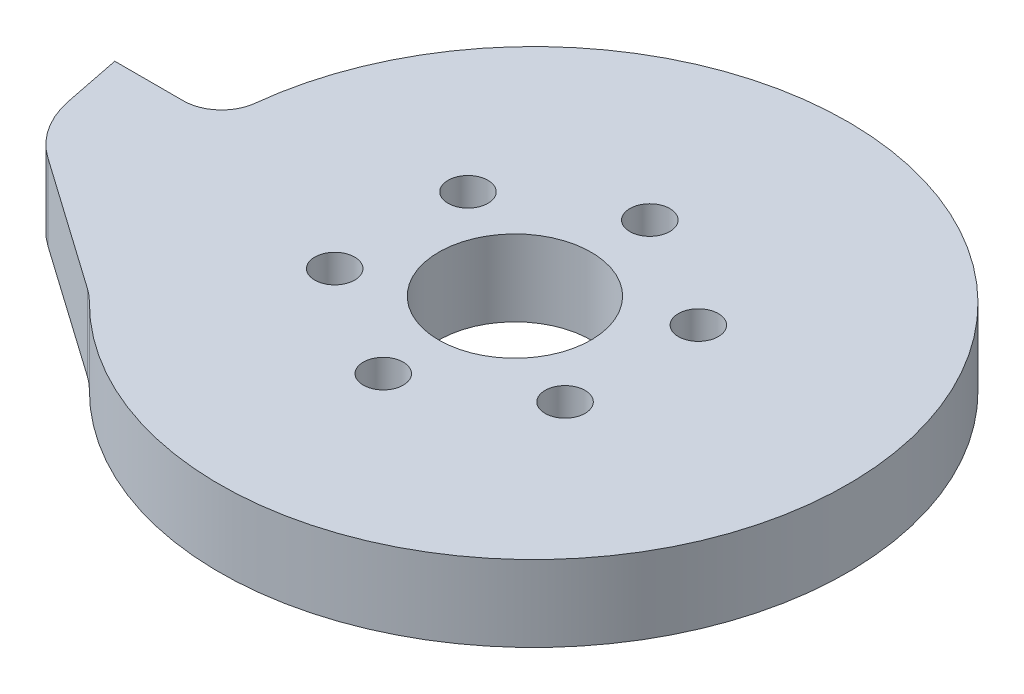
ISO-10303-21;
HEADER;
FILE_DESCRIPTION(('STEP AP214'),'2;1');
FILE_NAME('part.step','',(''),(''),'','','');
FILE_SCHEMA(('AUTOMOTIVE_DESIGN { 1 0 10303 214 1 1 1 1 }'));
ENDSEC;
DATA;
#1=APPLICATION_CONTEXT('core data for automotive mechanical design processes');
#2=APPLICATION_PROTOCOL_DEFINITION('international standard','automotive_design',2000,#1);
#3=PRODUCT_CONTEXT('',#1,'mechanical');
#4=PRODUCT('Part','Part','',(#3));
#5=PRODUCT_RELATED_PRODUCT_CATEGORY('part','',(#4));
#6=PRODUCT_DEFINITION_FORMATION('','',#4);
#7=PRODUCT_DEFINITION_CONTEXT('part definition',#1,'design');
#8=PRODUCT_DEFINITION('design','',#6,#7);
#9=PRODUCT_DEFINITION_SHAPE('','',#8);
#10=(LENGTH_UNIT() NAMED_UNIT(*) SI_UNIT(.MILLI.,.METRE.));
#11=(NAMED_UNIT(*) PLANE_ANGLE_UNIT() SI_UNIT($,.RADIAN.));
#12=(NAMED_UNIT(*) SI_UNIT($,.STERADIAN.) SOLID_ANGLE_UNIT());
#13=UNCERTAINTY_MEASURE_WITH_UNIT(LENGTH_MEASURE(1.E-05),#10,'distance_accuracy_value','');
#14=(GEOMETRIC_REPRESENTATION_CONTEXT(3) GLOBAL_UNCERTAINTY_ASSIGNED_CONTEXT((#13)) GLOBAL_UNIT_ASSIGNED_CONTEXT((#10,
#11,#12)) REPRESENTATION_CONTEXT('',''));
#15=CARTESIAN_POINT('',(0.,0.,0.));
#16=DIRECTION('',(0.,0.,1.));
#17=DIRECTION('',(1.,0.,0.));
#18=AXIS2_PLACEMENT_3D('',#15,#16,#17);
#19=CARTESIAN_POINT('',(0.,8.,0.));
#20=DIRECTION('',(0.,-1.,0.));
#21=DIRECTION('',(0.,0.,-1.));
#22=AXIS2_PLACEMENT_3D('',#19,#20,#21);
#23=PLANE('',#22);
#24=CARTESIAN_POINT('',(-1.45237262441028,8.,-13.6489964305643));
#25=DIRECTION('',(0.,1.,0.));
#26=DIRECTION('',(0.,0.,1.));
#27=AXIS2_PLACEMENT_3D('',#24,#25,#26);
#28=CIRCLE('',#27,2.1);
#29=CARTESIAN_POINT('',(-1.45237262441028,8.,-11.5489964305643));
#30=VERTEX_POINT('',#29);
#31=EDGE_CURVE('E198',#30,#30,#28,.T.);
#32=ORIENTED_EDGE('',*,*,#31,.F.);
#33=EDGE_LOOP('',(#32));
#34=FACE_BOUND('',#33,.T.);
#35=CARTESIAN_POINT('',(-13.5704044247265,8.,-6.66966658707766));
#36=DIRECTION('',(0.,1.,0.));
#37=DIRECTION('',(0.,0.,1.));
#38=AXIS2_PLACEMENT_3D('',#35,#36,#37);
#39=CIRCLE('',#38,2.1);
#40=CARTESIAN_POINT('',(-13.5704044247265,8.,-4.56966658707766));
#41=VERTEX_POINT('',#40);
#42=EDGE_CURVE('E199',#41,#41,#39,.T.);
#43=ORIENTED_EDGE('',*,*,#42,.F.);
#44=EDGE_LOOP('',(#43));
#45=FACE_BOUND('',#44,.T.);
#46=CARTESIAN_POINT('',(-13.5851433790342,8.,7.31452171760717));
#47=DIRECTION('',(0.,1.,0.));
#48=DIRECTION('',(0.,0.,1.));
#49=AXIS2_PLACEMENT_3D('',#46,#47,#48);
#50=CIRCLE('',#49,2.1);
#51=CARTESIAN_POINT('',(-13.5851433790342,8.,9.41452171760717));
#52=VERTEX_POINT('',#51);
#53=EDGE_CURVE('E173',#52,#52,#50,.T.);
#54=ORIENTED_EDGE('',*,*,#53,.F.);
#55=EDGE_LOOP('',(#54));
#56=FACE_BOUND('',#55,.T.);
#57=CARTESIAN_POINT('',(-1.48185053302583,8.,14.3193801788053));
#58=DIRECTION('',(0.,1.,0.));
#59=DIRECTION('',(0.,0.,1.));
#60=AXIS2_PLACEMENT_3D('',#57,#58,#59);
#61=CIRCLE('',#60,2.1);
#62=CARTESIAN_POINT('',(-1.48185053302583,8.,16.4193801788053));
#63=VERTEX_POINT('',#62);
#64=EDGE_CURVE('E180',#63,#63,#61,.T.);
#65=ORIENTED_EDGE('',*,*,#64,.F.);
#66=EDGE_LOOP('',(#65));
#67=FACE_BOUND('',#66,.T.);
#68=CARTESIAN_POINT('',(10.6361812672904,8.,7.34005033531866));
#69=DIRECTION('',(0.,1.,0.));
#70=DIRECTION('',(0.,0.,1.));
#71=AXIS2_PLACEMENT_3D('',#68,#69,#70);
#72=CIRCLE('',#71,2.1);
#73=CARTESIAN_POINT('',(10.6361812672904,8.,9.44005033531866));
#74=VERTEX_POINT('',#73);
#75=EDGE_CURVE('E186',#74,#74,#72,.T.);
#76=ORIENTED_EDGE('',*,*,#75,.F.);
#77=EDGE_LOOP('',(#76));
#78=FACE_BOUND('',#77,.T.);
#79=CARTESIAN_POINT('',(10.6509202215981,8.,-6.64413796936617));
#80=DIRECTION('',(0.,1.,0.));
#81=DIRECTION('',(0.,0.,1.));
#82=AXIS2_PLACEMENT_3D('',#79,#80,#81);
#83=CIRCLE('',#82,2.1);
#84=CARTESIAN_POINT('',(10.6509202215981,8.,-4.54413796936617));
#85=VERTEX_POINT('',#84);
#86=EDGE_CURVE('E192',#85,#85,#83,.T.);
#87=ORIENTED_EDGE('',*,*,#86,.F.);
#88=EDGE_LOOP('',(#87));
#89=FACE_BOUND('',#88,.T.);
#90=DIRECTION('',(0.196116135138184,0.,0.98058067569092));
#91=VECTOR('',#90,1.);
#92=CARTESIAN_POINT('',(-44.,8.,0.));
#93=LINE('',#92,#91);
#94=CARTESIAN_POINT('',(-44.,8.,0.));
#95=VERTEX_POINT('',#94);
#96=CARTESIAN_POINT('',(-42.7842582914051,8.,6.07870854297468));
#97=VERTEX_POINT('',#96);
#98=EDGE_CURVE('E99',#95,#97,#93,.T.);
#99=ORIENTED_EDGE('',*,*,#98,.T.);
#100=CARTESIAN_POINT('',(-32.9784515344959,8.,4.11754719159284));
#101=DIRECTION('',(0.,-1.,0.));
#102=DIRECTION('',(0.,0.,-1.));
#103=AXIS2_PLACEMENT_3D('',#100,#101,#102);
#104=CIRCLE('',#103,10.);
#105=CARTESIAN_POINT('',(-38.7281667595452,8.,12.2992814106222));
#106=VERTEX_POINT('',#105);
#107=EDGE_CURVE('E149',#97,#106,#104,.F.);
#108=ORIENTED_EDGE('',*,*,#107,.T.);
#109=DIRECTION('',(0.818173421902933,0.,0.574971522504937));
#110=VECTOR('',#109,1.);
#111=CARTESIAN_POINT('',(-42.,8.,10.));
#112=LINE('',#111,#110);
#113=CARTESIAN_POINT('',(-24.7730111832336,8.,22.1062695548265));
#114=VERTEX_POINT('',#113);
#115=EDGE_CURVE('E114',#106,#114,#112,.T.);
#116=ORIENTED_EDGE('',*,*,#115,.T.);
#117=CARTESIAN_POINT('',(-30.522726408283,8.,30.2880037738559));
#118=DIRECTION('',(0.,-1.,0.));
#119=DIRECTION('',(0.,0.,-1.));
#120=AXIS2_PLACEMENT_3D('',#117,#118,#119);
#121=CIRCLE('',#120,10.);
#122=CARTESIAN_POINT('',(-23.4244179412404,8.,23.2442819659824));
#123=VERTEX_POINT('',#122);
#124=EDGE_CURVE('E11',#114,#123,#121,.T.);
#125=ORIENTED_EDGE('',*,*,#124,.T.);
#126=CARTESIAN_POINT('',(0.,8.,0.));
#127=DIRECTION('',(0.,1.,0.));
#128=DIRECTION('',(0.,0.,-1.));
#129=AXIS2_PLACEMENT_3D('',#126,#127,#128);
#130=CIRCLE('',#129,33.);
#131=CARTESIAN_POINT('',(-32.8065917408505,8.,-3.56756756756757));
#132=VERTEX_POINT('',#131);
#133=EDGE_CURVE('E106',#123,#132,#130,.T.);
#134=ORIENTED_EDGE('',*,*,#133,.T.);
#135=CARTESIAN_POINT('',(-36.783148315499,8.,-4.));
#136=DIRECTION('',(0.,-1.,0.));
#137=DIRECTION('',(0.,0.,-1.));
#138=AXIS2_PLACEMENT_3D('',#135,#136,#137);
#139=CIRCLE('',#138,4.);
#140=CARTESIAN_POINT('',(-36.783148315499,8.,0.));
#141=VERTEX_POINT('',#140);
#142=EDGE_CURVE('E102',#132,#141,#139,.T.);
#143=ORIENTED_EDGE('',*,*,#142,.T.);
#144=DIRECTION('',(-1.,0.,0.));
#145=VECTOR('',#144,1.);
#146=CARTESIAN_POINT('',(-33.,8.,0.));
#147=LINE('',#146,#145);
#148=EDGE_CURVE('E96',#141,#95,#147,.T.);
#149=ORIENTED_EDGE('',*,*,#148,.T.);
#150=EDGE_LOOP('',(#99,#108,#116,#125,#134,#143,#149));
#151=FACE_BOUND('',#150,.T.);
#152=CARTESIAN_POINT('',(-1.62,8.,0.35));
#153=DIRECTION('',(0.,1.,0.));
#154=DIRECTION('',(0.,0.,1.));
#155=AXIS2_PLACEMENT_3D('',#152,#153,#154);
#156=CIRCLE('',#155,8.);
#157=CARTESIAN_POINT('',(-1.62,8.,8.35));
#158=VERTEX_POINT('',#157);
#159=EDGE_CURVE('E124',#158,#158,#156,.T.);
#160=ORIENTED_EDGE('',*,*,#159,.F.);
#161=EDGE_LOOP('',(#160));
#162=FACE_BOUND('',#161,.T.);
#163=ADVANCED_FACE('F37',(#34,#45,#56,#67,#78,#89,#151,#162),#23,.F.);
#164=CARTESIAN_POINT('',(0.,0.,0.));
#165=DIRECTION('',(0.,-1.,0.));
#166=DIRECTION('',(0.,0.,-1.));
#167=AXIS2_PLACEMENT_3D('',#164,#165,#166);
#168=PLANE('',#167);
#169=CARTESIAN_POINT('',(-1.45237262441028,0.,-13.6489964305643));
#170=DIRECTION('',(0.,1.,0.));
#171=DIRECTION('',(0.,0.,1.));
#172=AXIS2_PLACEMENT_3D('',#169,#170,#171);
#173=CIRCLE('',#172,2.1);
#174=CARTESIAN_POINT('',(-1.45237262441028,0.,-11.5489964305643));
#175=VERTEX_POINT('',#174);
#176=EDGE_CURVE('E170',#175,#175,#173,.T.);
#177=ORIENTED_EDGE('',*,*,#176,.T.);
#178=EDGE_LOOP('',(#177));
#179=FACE_BOUND('',#178,.T.);
#180=CARTESIAN_POINT('',(-13.5704044247265,0.,-6.66966658707766));
#181=DIRECTION('',(0.,1.,0.));
#182=DIRECTION('',(0.,0.,1.));
#183=AXIS2_PLACEMENT_3D('',#180,#181,#182);
#184=CIRCLE('',#183,2.1);
#185=CARTESIAN_POINT('',(-13.5704044247265,0.,-4.56966658707766));
#186=VERTEX_POINT('',#185);
#187=EDGE_CURVE('E177',#186,#186,#184,.T.);
#188=ORIENTED_EDGE('',*,*,#187,.T.);
#189=EDGE_LOOP('',(#188));
#190=FACE_BOUND('',#189,.T.);
#191=CARTESIAN_POINT('',(-13.5851433790342,0.,7.31452171760717));
#192=DIRECTION('',(0.,1.,0.));
#193=DIRECTION('',(0.,0.,1.));
#194=AXIS2_PLACEMENT_3D('',#191,#192,#193);
#195=CIRCLE('',#194,2.1);
#196=CARTESIAN_POINT('',(-13.5851433790342,0.,9.41452171760717));
#197=VERTEX_POINT('',#196);
#198=EDGE_CURVE('E176',#197,#197,#195,.T.);
#199=ORIENTED_EDGE('',*,*,#198,.T.);
#200=EDGE_LOOP('',(#199));
#201=FACE_BOUND('',#200,.T.);
#202=CARTESIAN_POINT('',(-1.48185053302583,0.,14.3193801788053));
#203=DIRECTION('',(0.,1.,0.));
#204=DIRECTION('',(0.,0.,1.));
#205=AXIS2_PLACEMENT_3D('',#202,#203,#204);
#206=CIRCLE('',#205,2.1);
#207=CARTESIAN_POINT('',(-1.48185053302583,0.,16.4193801788053));
#208=VERTEX_POINT('',#207);
#209=EDGE_CURVE('E183',#208,#208,#206,.T.);
#210=ORIENTED_EDGE('',*,*,#209,.T.);
#211=EDGE_LOOP('',(#210));
#212=FACE_BOUND('',#211,.T.);
#213=CARTESIAN_POINT('',(10.6361812672904,0.,7.34005033531866));
#214=DIRECTION('',(0.,1.,0.));
#215=DIRECTION('',(0.,0.,1.));
#216=AXIS2_PLACEMENT_3D('',#213,#214,#215);
#217=CIRCLE('',#216,2.1);
#218=CARTESIAN_POINT('',(10.6361812672904,0.,9.44005033531866));
#219=VERTEX_POINT('',#218);
#220=EDGE_CURVE('E189',#219,#219,#217,.T.);
#221=ORIENTED_EDGE('',*,*,#220,.T.);
#222=EDGE_LOOP('',(#221));
#223=FACE_BOUND('',#222,.T.);
#224=CARTESIAN_POINT('',(10.6509202215981,0.,-6.64413796936617));
#225=DIRECTION('',(0.,1.,0.));
#226=DIRECTION('',(0.,0.,1.));
#227=AXIS2_PLACEMENT_3D('',#224,#225,#226);
#228=CIRCLE('',#227,2.1);
#229=CARTESIAN_POINT('',(10.6509202215981,0.,-4.54413796936617));
#230=VERTEX_POINT('',#229);
#231=EDGE_CURVE('E195',#230,#230,#228,.T.);
#232=ORIENTED_EDGE('',*,*,#231,.T.);
#233=EDGE_LOOP('',(#232));
#234=FACE_BOUND('',#233,.T.);
#235=DIRECTION('',(0.818173421902933,0.,0.574971522504937));
#236=VECTOR('',#235,1.);
#237=CARTESIAN_POINT('',(-42.,0.,10.));
#238=LINE('',#237,#236);
#239=CARTESIAN_POINT('',(-38.7281667595452,0.,12.2992814106222));
#240=VERTEX_POINT('',#239);
#241=CARTESIAN_POINT('',(-24.7730111832336,0.,22.1062695548265));
#242=VERTEX_POINT('',#241);
#243=EDGE_CURVE('E128',#240,#242,#238,.T.);
#244=ORIENTED_EDGE('',*,*,#243,.F.);
#245=CARTESIAN_POINT('',(-32.9784515344959,0.,4.11754719159284));
#246=DIRECTION('',(0.,-1.,0.));
#247=DIRECTION('',(0.,0.,-1.));
#248=AXIS2_PLACEMENT_3D('',#245,#246,#247);
#249=CIRCLE('',#248,10.);
#250=CARTESIAN_POINT('',(-42.7842582914051,0.,6.07870854297468));
#251=VERTEX_POINT('',#250);
#252=EDGE_CURVE('E60',#240,#251,#249,.T.);
#253=ORIENTED_EDGE('',*,*,#252,.T.);
#254=DIRECTION('',(0.196116135138184,0.,0.98058067569092));
#255=VECTOR('',#254,1.);
#256=CARTESIAN_POINT('',(-44.,0.,0.));
#257=LINE('',#256,#255);
#258=CARTESIAN_POINT('',(-44.,0.,0.));
#259=VERTEX_POINT('',#258);
#260=EDGE_CURVE('E126',#259,#251,#257,.T.);
#261=ORIENTED_EDGE('',*,*,#260,.F.);
#262=DIRECTION('',(-1.,0.,0.));
#263=VECTOR('',#262,1.);
#264=CARTESIAN_POINT('',(-33.,0.,0.));
#265=LINE('',#264,#263);
#266=CARTESIAN_POINT('',(-36.783148315499,0.,0.));
#267=VERTEX_POINT('',#266);
#268=EDGE_CURVE('E112',#267,#259,#265,.T.);
#269=ORIENTED_EDGE('',*,*,#268,.F.);
#270=CARTESIAN_POINT('',(-36.783148315499,0.,-4.));
#271=DIRECTION('',(0.,-1.,0.));
#272=DIRECTION('',(0.,0.,-1.));
#273=AXIS2_PLACEMENT_3D('',#270,#271,#272);
#274=CIRCLE('',#273,4.);
#275=CARTESIAN_POINT('',(-32.8065917408505,0.,-3.56756756756757));
#276=VERTEX_POINT('',#275);
#277=EDGE_CURVE('E135',#267,#276,#274,.F.);
#278=ORIENTED_EDGE('',*,*,#277,.T.);
#279=CARTESIAN_POINT('',(0.,0.,0.));
#280=DIRECTION('',(0.,1.,0.));
#281=DIRECTION('',(0.,0.,-1.));
#282=AXIS2_PLACEMENT_3D('',#279,#280,#281);
#283=CIRCLE('',#282,33.);
#284=CARTESIAN_POINT('',(-23.4244179412404,0.,23.2442819659824));
#285=VERTEX_POINT('',#284);
#286=EDGE_CURVE('E122',#285,#276,#283,.T.);
#287=ORIENTED_EDGE('',*,*,#286,.F.);
#288=CARTESIAN_POINT('',(-30.522726408283,0.,30.2880037738559));
#289=DIRECTION('',(0.,-1.,0.));
#290=DIRECTION('',(0.,0.,-1.));
#291=AXIS2_PLACEMENT_3D('',#288,#289,#290);
#292=CIRCLE('',#291,10.);
#293=EDGE_CURVE('E45',#285,#242,#292,.F.);
#294=ORIENTED_EDGE('',*,*,#293,.T.);
#295=EDGE_LOOP('',(#244,#253,#261,#269,#278,#287,#294));
#296=FACE_BOUND('',#295,.T.);
#297=CARTESIAN_POINT('',(-1.62,0.,0.35));
#298=DIRECTION('',(0.,1.,0.));
#299=DIRECTION('',(0.,0.,1.));
#300=AXIS2_PLACEMENT_3D('',#297,#298,#299);
#301=CIRCLE('',#300,8.);
#302=CARTESIAN_POINT('',(-1.62,0.,8.35));
#303=VERTEX_POINT('',#302);
#304=EDGE_CURVE('E167',#303,#303,#301,.T.);
#305=ORIENTED_EDGE('',*,*,#304,.T.);
#306=EDGE_LOOP('',(#305));
#307=FACE_BOUND('',#306,.T.);
#308=ADVANCED_FACE('F151',(#179,#190,#201,#212,#223,#234,#296,#307),#168,.T.);
#309=CARTESIAN_POINT('',(0.,8.,0.));
#310=DIRECTION('',(0.,-1.,0.));
#311=DIRECTION('',(0.,0.,-1.));
#312=AXIS2_PLACEMENT_3D('',#309,#310,#311);
#313=CYLINDRICAL_SURFACE('',#312,33.);
#314=ORIENTED_EDGE('',*,*,#133,.F.);
#315=DIRECTION('',(0.,-1.,0.));
#316=VECTOR('',#315,1.);
#317=CARTESIAN_POINT('',(-23.4244179412404,8.,23.2442819659824));
#318=LINE('',#317,#316);
#319=EDGE_CURVE('E139',#123,#285,#318,.T.);
#320=ORIENTED_EDGE('',*,*,#319,.T.);
#321=ORIENTED_EDGE('',*,*,#286,.T.);
#322=DIRECTION('',(0.,-1.,0.));
#323=VECTOR('',#322,1.);
#324=CARTESIAN_POINT('',(-32.8065917408505,8.,-3.56756756756757));
#325=LINE('',#324,#323);
#326=EDGE_CURVE('E132',#276,#132,#325,.F.);
#327=ORIENTED_EDGE('',*,*,#326,.T.);
#328=EDGE_LOOP('',(#314,#320,#321,#327));
#329=FACE_BOUND('',#328,.T.);
#330=ADVANCED_FACE('F164',(#329),#313,.T.);
#331=CARTESIAN_POINT('',(-33.,8.,0.));
#332=DIRECTION('',(0.,0.,1.));
#333=DIRECTION('',(1.,0.,0.));
#334=AXIS2_PLACEMENT_3D('',#331,#332,#333);
#335=PLANE('',#334);
#336=ORIENTED_EDGE('',*,*,#148,.F.);
#337=DIRECTION('',(0.,1.,0.));
#338=VECTOR('',#337,1.);
#339=CARTESIAN_POINT('',(-36.783148315499,0.,0.));
#340=LINE('',#339,#338);
#341=EDGE_CURVE('E113',#141,#267,#340,.F.);
#342=ORIENTED_EDGE('',*,*,#341,.T.);
#343=ORIENTED_EDGE('',*,*,#268,.T.);
#344=DIRECTION('',(0.,-1.,0.));
#345=VECTOR('',#344,1.);
#346=CARTESIAN_POINT('',(-44.,8.,0.));
#347=LINE('',#346,#345);
#348=EDGE_CURVE('E109',#95,#259,#347,.T.);
#349=ORIENTED_EDGE('',*,*,#348,.F.);
#350=EDGE_LOOP('',(#336,#342,#343,#349));
#351=FACE_BOUND('',#350,.T.);
#352=ADVANCED_FACE('F110',(#351),#335,.F.);
#353=CARTESIAN_POINT('',(-44.,8.,0.));
#354=DIRECTION('',(0.98058067569092,0.,-0.196116135138184));
#355=DIRECTION('',(-0.196116135138184,0.,-0.98058067569092));
#356=AXIS2_PLACEMENT_3D('',#353,#354,#355);
#357=PLANE('',#356);
#358=ORIENTED_EDGE('',*,*,#260,.T.);
#359=DIRECTION('',(0.,-1.,0.));
#360=VECTOR('',#359,1.);
#361=CARTESIAN_POINT('',(-42.7842582914051,8.,6.07870854297468));
#362=LINE('',#361,#360);
#363=EDGE_CURVE('E52',#251,#97,#362,.F.);
#364=ORIENTED_EDGE('',*,*,#363,.T.);
#365=ORIENTED_EDGE('',*,*,#98,.F.);
#366=ORIENTED_EDGE('',*,*,#348,.T.);
#367=EDGE_LOOP('',(#358,#364,#365,#366));
#368=FACE_BOUND('',#367,.T.);
#369=ADVANCED_FACE('F116',(#368),#357,.F.);
#370=CARTESIAN_POINT('',(-42.,8.,10.));
#371=DIRECTION('',(0.574971522504937,0.,-0.818173421902933));
#372=DIRECTION('',(-0.818173421902933,0.,-0.574971522504937));
#373=AXIS2_PLACEMENT_3D('',#370,#371,#372);
#374=PLANE('',#373);
#375=ORIENTED_EDGE('',*,*,#243,.T.);
#376=DIRECTION('',(0.,1.,0.));
#377=VECTOR('',#376,1.);
#378=CARTESIAN_POINT('',(-24.7730111832336,8.,22.1062695548265));
#379=LINE('',#378,#377);
#380=EDGE_CURVE('E145',#242,#114,#379,.T.);
#381=ORIENTED_EDGE('',*,*,#380,.T.);
#382=ORIENTED_EDGE('',*,*,#115,.F.);
#383=DIRECTION('',(0.,-1.,0.));
#384=VECTOR('',#383,1.);
#385=CARTESIAN_POINT('',(-38.7281667595452,8.,12.2992814106222));
#386=LINE('',#385,#384);
#387=EDGE_CURVE('E142',#106,#240,#386,.T.);
#388=ORIENTED_EDGE('',*,*,#387,.T.);
#389=EDGE_LOOP('',(#375,#381,#382,#388));
#390=FACE_BOUND('',#389,.T.);
#391=ADVANCED_FACE('F157',(#390),#374,.F.);
#392=CARTESIAN_POINT('',(-1.62,8.,0.35));
#393=DIRECTION('',(0.,-1.,0.));
#394=DIRECTION('',(0.,0.,-1.));
#395=AXIS2_PLACEMENT_3D('',#392,#393,#394);
#396=CYLINDRICAL_SURFACE('',#395,8.);
#397=ORIENTED_EDGE('',*,*,#159,.T.);
#398=EDGE_LOOP('',(#397));
#399=FACE_BOUND('',#398,.T.);
#400=ORIENTED_EDGE('',*,*,#304,.F.);
#401=EDGE_LOOP('',(#400));
#402=FACE_BOUND('',#401,.T.);
#403=ADVANCED_FACE('F254',(#399,#402),#396,.F.);
#404=CARTESIAN_POINT('',(-36.783148315499,8.,-4.));
#405=DIRECTION('',(0.,-1.,0.));
#406=DIRECTION('',(0.,0.,-1.));
#407=AXIS2_PLACEMENT_3D('',#404,#405,#406);
#408=CYLINDRICAL_SURFACE('',#407,4.);
#409=ORIENTED_EDGE('',*,*,#142,.F.);
#410=ORIENTED_EDGE('',*,*,#326,.F.);
#411=ORIENTED_EDGE('',*,*,#277,.F.);
#412=ORIENTED_EDGE('',*,*,#341,.F.);
#413=EDGE_LOOP('',(#409,#410,#411,#412));
#414=FACE_BOUND('',#413,.T.);
#415=ADVANCED_FACE('F256',(#414),#408,.F.);
#416=CARTESIAN_POINT('',(-30.522726408283,8.,30.2880037738559));
#417=DIRECTION('',(0.,-1.,0.));
#418=DIRECTION('',(0.,0.,-1.));
#419=AXIS2_PLACEMENT_3D('',#416,#417,#418);
#420=CYLINDRICAL_SURFACE('',#419,10.);
#421=ORIENTED_EDGE('',*,*,#124,.F.);
#422=ORIENTED_EDGE('',*,*,#380,.F.);
#423=ORIENTED_EDGE('',*,*,#293,.F.);
#424=ORIENTED_EDGE('',*,*,#319,.F.);
#425=EDGE_LOOP('',(#421,#422,#423,#424));
#426=FACE_BOUND('',#425,.T.);
#427=ADVANCED_FACE('F161',(#426),#420,.F.);
#428=CARTESIAN_POINT('',(-32.9784515344959,8.,4.11754719159284));
#429=DIRECTION('',(0.,-1.,0.));
#430=DIRECTION('',(0.,0.,-1.));
#431=AXIS2_PLACEMENT_3D('',#428,#429,#430);
#432=CYLINDRICAL_SURFACE('',#431,10.);
#433=ORIENTED_EDGE('',*,*,#107,.F.);
#434=ORIENTED_EDGE('',*,*,#363,.F.);
#435=ORIENTED_EDGE('',*,*,#252,.F.);
#436=ORIENTED_EDGE('',*,*,#387,.F.);
#437=EDGE_LOOP('',(#433,#434,#435,#436));
#438=FACE_BOUND('',#437,.T.);
#439=ADVANCED_FACE('F39',(#438),#432,.T.);
#440=CARTESIAN_POINT('',(10.6509202215981,0.,-6.64413796936617));
#441=DIRECTION('',(0.,1.,0.));
#442=DIRECTION('',(0.,0.,1.));
#443=AXIS2_PLACEMENT_3D('',#440,#441,#442);
#444=CYLINDRICAL_SURFACE('',#443,2.1);
#445=ORIENTED_EDGE('',*,*,#231,.F.);
#446=EDGE_LOOP('',(#445));
#447=FACE_BOUND('',#446,.T.);
#448=ORIENTED_EDGE('',*,*,#86,.T.);
#449=EDGE_LOOP('',(#448));
#450=FACE_BOUND('',#449,.T.);
#451=ADVANCED_FACE('F231',(#447,#450),#444,.F.);
#452=CARTESIAN_POINT('',(10.6361812672904,0.,7.34005033531866));
#453=DIRECTION('',(0.,1.,0.));
#454=DIRECTION('',(0.,0.,1.));
#455=AXIS2_PLACEMENT_3D('',#452,#453,#454);
#456=CYLINDRICAL_SURFACE('',#455,2.1);
#457=ORIENTED_EDGE('',*,*,#220,.F.);
#458=EDGE_LOOP('',(#457));
#459=FACE_BOUND('',#458,.T.);
#460=ORIENTED_EDGE('',*,*,#75,.T.);
#461=EDGE_LOOP('',(#460));
#462=FACE_BOUND('',#461,.T.);
#463=ADVANCED_FACE('F233',(#459,#462),#456,.F.);
#464=CARTESIAN_POINT('',(-1.48185053302583,0.,14.3193801788053));
#465=DIRECTION('',(0.,1.,0.));
#466=DIRECTION('',(0.,0.,1.));
#467=AXIS2_PLACEMENT_3D('',#464,#465,#466);
#468=CYLINDRICAL_SURFACE('',#467,2.1);
#469=ORIENTED_EDGE('',*,*,#209,.F.);
#470=EDGE_LOOP('',(#469));
#471=FACE_BOUND('',#470,.T.);
#472=ORIENTED_EDGE('',*,*,#64,.T.);
#473=EDGE_LOOP('',(#472));
#474=FACE_BOUND('',#473,.T.);
#475=ADVANCED_FACE('F240',(#471,#474),#468,.F.);
#476=CARTESIAN_POINT('',(-13.5851433790342,0.,7.31452171760717));
#477=DIRECTION('',(0.,1.,0.));
#478=DIRECTION('',(0.,0.,1.));
#479=AXIS2_PLACEMENT_3D('',#476,#477,#478);
#480=CYLINDRICAL_SURFACE('',#479,2.1);
#481=ORIENTED_EDGE('',*,*,#198,.F.);
#482=EDGE_LOOP('',(#481));
#483=FACE_BOUND('',#482,.T.);
#484=ORIENTED_EDGE('',*,*,#53,.T.);
#485=EDGE_LOOP('',(#484));
#486=FACE_BOUND('',#485,.T.);
#487=ADVANCED_FACE('F249',(#483,#486),#480,.F.);
#488=CARTESIAN_POINT('',(-13.5704044247265,0.,-6.66966658707766));
#489=DIRECTION('',(0.,1.,0.));
#490=DIRECTION('',(0.,0.,1.));
#491=AXIS2_PLACEMENT_3D('',#488,#489,#490);
#492=CYLINDRICAL_SURFACE('',#491,2.1);
#493=ORIENTED_EDGE('',*,*,#187,.F.);
#494=EDGE_LOOP('',(#493));
#495=FACE_BOUND('',#494,.T.);
#496=ORIENTED_EDGE('',*,*,#42,.T.);
#497=EDGE_LOOP('',(#496));
#498=FACE_BOUND('',#497,.T.);
#499=ADVANCED_FACE('F214',(#495,#498),#492,.F.);
#500=CARTESIAN_POINT('',(-1.45237262441028,0.,-13.6489964305643));
#501=DIRECTION('',(0.,1.,0.));
#502=DIRECTION('',(0.,0.,1.));
#503=AXIS2_PLACEMENT_3D('',#500,#501,#502);
#504=CYLINDRICAL_SURFACE('',#503,2.1);
#505=ORIENTED_EDGE('',*,*,#176,.F.);
#506=EDGE_LOOP('',(#505));
#507=FACE_BOUND('',#506,.T.);
#508=ORIENTED_EDGE('',*,*,#31,.T.);
#509=EDGE_LOOP('',(#508));
#510=FACE_BOUND('',#509,.T.);
#511=ADVANCED_FACE('F211',(#507,#510),#504,.F.);
#512=CLOSED_SHELL('',(#163,#308,#330,#352,#369,#391,#403,#415,#427,#439,#451,#463,#475,#487,
#499,#511));
#513=MANIFOLD_SOLID_BREP('B2',#512);
#514=ADVANCED_BREP_SHAPE_REPRESENTATION('',(#18,#513),#14);
#515=SHAPE_DEFINITION_REPRESENTATION(#9,#514);
ENDSEC;
END-ISO-10303-21;
